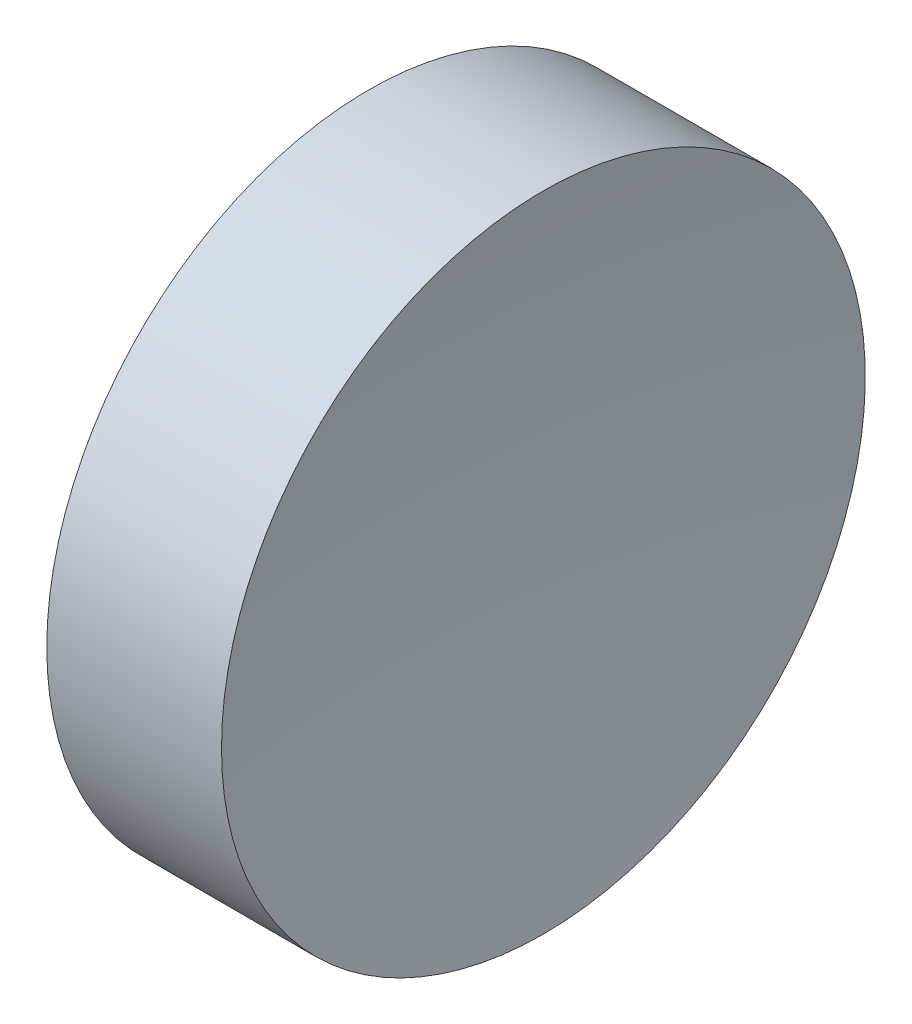
ISO-10303-21;
HEADER;
FILE_DESCRIPTION(('STEP AP214'),'2;1');
FILE_NAME('part.step','',(''),(''),'','','');
FILE_SCHEMA(('AUTOMOTIVE_DESIGN { 1 0 10303 214 1 1 1 1 }'));
ENDSEC;
DATA;
#1=APPLICATION_CONTEXT('core data for automotive mechanical design processes');
#2=APPLICATION_PROTOCOL_DEFINITION('international standard','automotive_design',2000,#1);
#3=PRODUCT_CONTEXT('',#1,'mechanical');
#4=PRODUCT('Part','Part','',(#3));
#5=PRODUCT_RELATED_PRODUCT_CATEGORY('part','',(#4));
#6=PRODUCT_DEFINITION_FORMATION('','',#4);
#7=PRODUCT_DEFINITION_CONTEXT('part definition',#1,'design');
#8=PRODUCT_DEFINITION('design','',#6,#7);
#9=PRODUCT_DEFINITION_SHAPE('','',#8);
#10=(LENGTH_UNIT() NAMED_UNIT(*) SI_UNIT(.MILLI.,.METRE.));
#11=(NAMED_UNIT(*) PLANE_ANGLE_UNIT() SI_UNIT($,.RADIAN.));
#12=(NAMED_UNIT(*) SI_UNIT($,.STERADIAN.) SOLID_ANGLE_UNIT());
#13=UNCERTAINTY_MEASURE_WITH_UNIT(LENGTH_MEASURE(1.E-05),#10,'distance_accuracy_value','');
#14=(GEOMETRIC_REPRESENTATION_CONTEXT(3) GLOBAL_UNCERTAINTY_ASSIGNED_CONTEXT((#13)) GLOBAL_UNIT_ASSIGNED_CONTEXT((#10,
#11,#12)) REPRESENTATION_CONTEXT('',''));
#15=CARTESIAN_POINT('',(0.,0.,0.));
#16=DIRECTION('',(0.,0.,1.));
#17=DIRECTION('',(1.,0.,0.));
#18=AXIS2_PLACEMENT_3D('',#15,#16,#17);
#19=CARTESIAN_POINT('',(110.546327601967,34.6890105616862,0.));
#20=DIRECTION('',(-1.,0.,0.));
#21=DIRECTION('',(0.,-1.,0.));
#22=AXIS2_PLACEMENT_3D('',#19,#20,#21);
#23=SPHERICAL_SURFACE('',#22,50.);
#24=CARTESIAN_POINT('',(60.938490519506,34.6890105616862,0.));
#25=DIRECTION('',(-1.,0.,0.));
#26=DIRECTION('',(0.,0.,1.));
#27=AXIS2_PLACEMENT_3D('',#24,#25,#26);
#28=CIRCLE('',#27,6.25000000000001);
#29=CARTESIAN_POINT('',(60.938490519506,34.6890105616862,6.25000000000001));
#30=VERTEX_POINT('',#29);
#31=EDGE_CURVE('E10',#30,#30,#28,.T.);
#32=ORIENTED_EDGE('',*,*,#31,.F.);
#33=EDGE_LOOP('',(#32));
#34=FACE_BOUND('',#33,.T.);
#35=ADVANCED_FACE('F35',(#34),#23,.F.);
#36=CARTESIAN_POINT('',(54.4925715010826,34.6890105616862,0.));
#37=DIRECTION('',(-1.,0.,0.));
#38=DIRECTION('',(0.,0.,1.));
#39=AXIS2_PLACEMENT_3D('',#36,#37,#38);
#40=CYLINDRICAL_SURFACE('',#39,6.25);
#41=CARTESIAN_POINT('',(57.5463277674598,34.6890105616862,0.));
#42=DIRECTION('',(-1.,0.,0.));
#43=DIRECTION('',(0.,0.,1.));
#44=AXIS2_PLACEMENT_3D('',#41,#42,#43);
#45=CIRCLE('',#44,6.25);
#46=CARTESIAN_POINT('',(57.5463277674598,34.6890105616862,6.25));
#47=VERTEX_POINT('',#46);
#48=EDGE_CURVE('E41',#47,#47,#45,.T.);
#49=ORIENTED_EDGE('',*,*,#48,.F.);
#50=EDGE_LOOP('',(#49));
#51=FACE_BOUND('',#50,.T.);
#52=ORIENTED_EDGE('',*,*,#31,.T.);
#53=EDGE_LOOP('',(#52));
#54=FACE_BOUND('',#53,.T.);
#55=ADVANCED_FACE('F49',(#51,#54),#40,.T.);
#56=CARTESIAN_POINT('',(57.5463277674598,34.6890105616862,0.));
#57=DIRECTION('',(1.,0.,0.));
#58=DIRECTION('',(0.,0.,-1.));
#59=AXIS2_PLACEMENT_3D('',#56,#57,#58);
#60=PLANE('',#59);
#61=ORIENTED_EDGE('',*,*,#48,.T.);
#62=EDGE_LOOP('',(#61));
#63=FACE_BOUND('',#62,.T.);
#64=ADVANCED_FACE('F47',(#63),#60,.F.);
#65=CLOSED_SHELL('',(#35,#55,#64));
#66=MANIFOLD_SOLID_BREP('B2',#65);
#67=ADVANCED_BREP_SHAPE_REPRESENTATION('',(#18,#66),#14);
#68=SHAPE_DEFINITION_REPRESENTATION(#9,#67);
ENDSEC;
END-ISO-10303-21;
